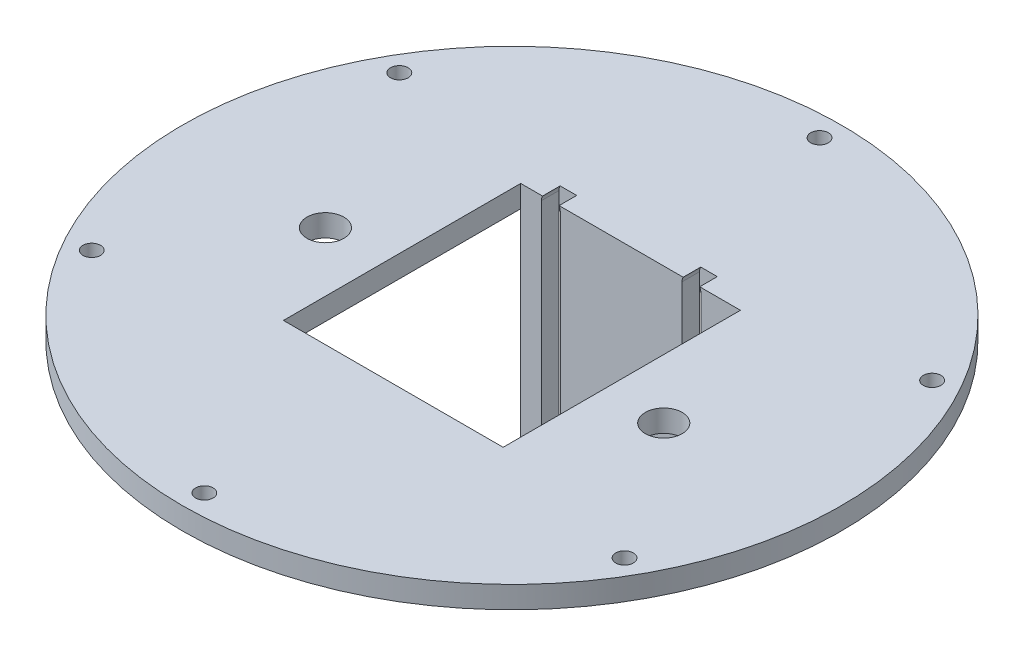
ISO-10303-21;
HEADER;
FILE_DESCRIPTION(('STEP AP214'),'2;1');
FILE_NAME('part.step','',(''),(''),'','','');
FILE_SCHEMA(('AUTOMOTIVE_DESIGN { 1 0 10303 214 1 1 1 1 }'));
ENDSEC;
DATA;
#1=APPLICATION_CONTEXT('core data for automotive mechanical design processes');
#2=APPLICATION_PROTOCOL_DEFINITION('international standard','automotive_design',2000,#1);
#3=PRODUCT_CONTEXT('',#1,'mechanical');
#4=PRODUCT('Part','Part','',(#3));
#5=PRODUCT_RELATED_PRODUCT_CATEGORY('part','',(#4));
#6=PRODUCT_DEFINITION_FORMATION('','',#4);
#7=PRODUCT_DEFINITION_CONTEXT('part definition',#1,'design');
#8=PRODUCT_DEFINITION('design','',#6,#7);
#9=PRODUCT_DEFINITION_SHAPE('','',#8);
#10=(LENGTH_UNIT() NAMED_UNIT(*) SI_UNIT(.MILLI.,.METRE.));
#11=(NAMED_UNIT(*) PLANE_ANGLE_UNIT() SI_UNIT($,.RADIAN.));
#12=(NAMED_UNIT(*) SI_UNIT($,.STERADIAN.) SOLID_ANGLE_UNIT());
#13=UNCERTAINTY_MEASURE_WITH_UNIT(LENGTH_MEASURE(1.E-05),#10,'distance_accuracy_value','');
#14=(GEOMETRIC_REPRESENTATION_CONTEXT(3) GLOBAL_UNCERTAINTY_ASSIGNED_CONTEXT((#13)) GLOBAL_UNIT_ASSIGNED_CONTEXT((#10,
#11,#12)) REPRESENTATION_CONTEXT('',''));
#15=CARTESIAN_POINT('',(0.,0.,0.));
#16=DIRECTION('',(0.,0.,1.));
#17=DIRECTION('',(1.,0.,0.));
#18=AXIS2_PLACEMENT_3D('',#15,#16,#17);
#19=CARTESIAN_POINT('',(0.,5.,0.));
#20=DIRECTION('',(0.,1.,0.));
#21=DIRECTION('',(0.,0.,1.));
#22=AXIS2_PLACEMENT_3D('',#19,#20,#21);
#23=PLANE('',#22);
#24=CARTESIAN_POINT('',(-8.49999999999939,5.,3.95000000000001));
#25=DIRECTION('',(0.,1.,0.));
#26=DIRECTION('',(0.,0.,1.));
#27=AXIS2_PLACEMENT_3D('',#24,#25,#26);
#28=CIRCLE('',#27,4.2);
#29=CARTESIAN_POINT('',(-8.49999999999939,5.,8.15000000000001));
#30=VERTEX_POINT('',#29);
#31=EDGE_CURVE('E264',#30,#30,#28,.T.);
#32=ORIENTED_EDGE('',*,*,#31,.F.);
#33=EDGE_LOOP('',(#32));
#34=FACE_BOUND('',#33,.T.);
#35=CARTESIAN_POINT('',(68.5000000000006,5.,3.94999999999992));
#36=DIRECTION('',(0.,1.,0.));
#37=DIRECTION('',(0.,0.,1.));
#38=AXIS2_PLACEMENT_3D('',#35,#36,#37);
#39=CIRCLE('',#38,4.19999999999999);
#40=CARTESIAN_POINT('',(68.5000000000006,5.,8.14999999999991));
#41=VERTEX_POINT('',#40);
#42=EDGE_CURVE('E269',#41,#41,#39,.T.);
#43=ORIENTED_EDGE('',*,*,#42,.F.);
#44=EDGE_LOOP('',(#43));
#45=FACE_BOUND('',#44,.T.);
#46=CARTESIAN_POINT('',(30.0000000000001,5.,70.));
#47=DIRECTION('',(0.,1.,0.));
#48=DIRECTION('',(0.,0.,1.));
#49=AXIS2_PLACEMENT_3D('',#46,#47,#48);
#50=CIRCLE('',#49,2.);
#51=CARTESIAN_POINT('',(30.0000000000001,5.,72.));
#52=VERTEX_POINT('',#51);
#53=EDGE_CURVE('E281',#52,#52,#50,.T.);
#54=ORIENTED_EDGE('',*,*,#53,.F.);
#55=EDGE_LOOP('',(#54));
#56=FACE_BOUND('',#55,.T.);
#57=CARTESIAN_POINT('',(90.6217782649104,5.,35.0000000000007));
#58=DIRECTION('',(0.,1.,0.));
#59=DIRECTION('',(0.,0.,1.));
#60=AXIS2_PLACEMENT_3D('',#57,#58,#59);
#61=CIRCLE('',#60,2.);
#62=CARTESIAN_POINT('',(90.6217782649104,5.,37.0000000000007));
#63=VERTEX_POINT('',#62);
#64=EDGE_CURVE('E273',#63,#63,#61,.T.);
#65=ORIENTED_EDGE('',*,*,#64,.F.);
#66=EDGE_LOOP('',(#65));
#67=FACE_BOUND('',#66,.T.);
#68=CARTESIAN_POINT('',(90.6217782649111,5.,-34.9999999999994));
#69=DIRECTION('',(0.,1.,0.));
#70=DIRECTION('',(0.,0.,1.));
#71=AXIS2_PLACEMENT_3D('',#68,#69,#70);
#72=CIRCLE('',#71,2.);
#73=CARTESIAN_POINT('',(90.6217782649111,5.,-32.9999999999994));
#74=VERTEX_POINT('',#73);
#75=EDGE_CURVE('E290',#74,#74,#72,.T.);
#76=ORIENTED_EDGE('',*,*,#75,.F.);
#77=EDGE_LOOP('',(#76));
#78=FACE_BOUND('',#77,.T.);
#79=CARTESIAN_POINT('',(30.0000000000006,5.,-70.));
#80=DIRECTION('',(0.,1.,0.));
#81=DIRECTION('',(0.,0.,1.));
#82=AXIS2_PLACEMENT_3D('',#79,#80,#81);
#83=CIRCLE('',#82,2.);
#84=CARTESIAN_POINT('',(30.0000000000006,5.,-68.));
#85=VERTEX_POINT('',#84);
#86=EDGE_CURVE('E298',#85,#85,#83,.T.);
#87=ORIENTED_EDGE('',*,*,#86,.F.);
#88=EDGE_LOOP('',(#87));
#89=FACE_BOUND('',#88,.T.);
#90=CARTESIAN_POINT('',(-30.6217782649105,5.,-35.0000000000003));
#91=DIRECTION('',(0.,1.,0.));
#92=DIRECTION('',(0.,0.,1.));
#93=AXIS2_PLACEMENT_3D('',#90,#91,#92);
#94=CIRCLE('',#93,2.);
#95=CARTESIAN_POINT('',(-30.6217782649105,5.,-33.0000000000003));
#96=VERTEX_POINT('',#95);
#97=EDGE_CURVE('E294',#96,#96,#94,.T.);
#98=ORIENTED_EDGE('',*,*,#97,.F.);
#99=EDGE_LOOP('',(#98));
#100=FACE_BOUND('',#99,.T.);
#101=CARTESIAN_POINT('',(-30.6217782649107,5.,34.9999999999999));
#102=DIRECTION('',(0.,1.,0.));
#103=DIRECTION('',(0.,0.,1.));
#104=AXIS2_PLACEMENT_3D('',#101,#102,#103);
#105=CIRCLE('',#104,2.);
#106=CARTESIAN_POINT('',(-30.6217782649107,5.,36.9999999999999));
#107=VERTEX_POINT('',#106);
#108=EDGE_CURVE('E286',#107,#107,#105,.T.);
#109=ORIENTED_EDGE('',*,*,#108,.F.);
#110=EDGE_LOOP('',(#109));
#111=FACE_BOUND('',#110,.T.);
#112=DIRECTION('',(0.,0.,1.));
#113=VECTOR('',#112,1.);
#114=CARTESIAN_POINT('',(9.96809122210273,5.,-70.3349662310456));
#115=LINE('',#114,#113);
#116=CARTESIAN_POINT('',(9.96809122210273,5.,-31.));
#117=VERTEX_POINT('',#116);
#118=CARTESIAN_POINT('',(9.96809122210273,5.,-27.));
#119=VERTEX_POINT('',#118);
#120=EDGE_CURVE('E338',#117,#119,#115,.T.);
#121=ORIENTED_EDGE('',*,*,#120,.F.);
#122=DIRECTION('',(1.,0.,0.));
#123=VECTOR('',#122,1.);
#124=CARTESIAN_POINT('',(0.,5.,-31.));
#125=LINE('',#124,#123);
#126=CARTESIAN_POINT('',(13.7319087778974,5.,-31.));
#127=VERTEX_POINT('',#126);
#128=EDGE_CURVE('E314',#117,#127,#125,.T.);
#129=ORIENTED_EDGE('',*,*,#128,.T.);
#130=DIRECTION('',(0.,0.,1.));
#131=VECTOR('',#130,1.);
#132=CARTESIAN_POINT('',(13.7319087778974,5.,-70.3349662310456));
#133=LINE('',#132,#131);
#134=CARTESIAN_POINT('',(13.7319087778974,5.,-27.));
#135=VERTEX_POINT('',#134);
#136=EDGE_CURVE('E341',#127,#135,#133,.T.);
#137=ORIENTED_EDGE('',*,*,#136,.T.);
#138=DIRECTION('',(-1.,0.,0.));
#139=VECTOR('',#138,1.);
#140=CARTESIAN_POINT('',(5.00000000000006,5.,-27.));
#141=LINE('',#140,#139);
#142=CARTESIAN_POINT('',(41.9680912221027,5.,-27.));
#143=VERTEX_POINT('',#142);
#144=EDGE_CURVE('E462',#143,#135,#141,.T.);
#145=ORIENTED_EDGE('',*,*,#144,.F.);
#146=DIRECTION('',(0.,0.,1.));
#147=VECTOR('',#146,1.);
#148=CARTESIAN_POINT('',(41.9680912221027,5.,-70.3349662310456));
#149=LINE('',#148,#147);
#150=CARTESIAN_POINT('',(41.9680912221027,5.,-31.));
#151=VERTEX_POINT('',#150);
#152=EDGE_CURVE('E382',#151,#143,#149,.T.);
#153=ORIENTED_EDGE('',*,*,#152,.F.);
#154=DIRECTION('',(1.,0.,0.));
#155=VECTOR('',#154,1.);
#156=CARTESIAN_POINT('',(0.,5.,-31.));
#157=LINE('',#156,#155);
#158=CARTESIAN_POINT('',(45.7319087778974,5.,-31.));
#159=VERTEX_POINT('',#158);
#160=EDGE_CURVE('E354',#151,#159,#157,.T.);
#161=ORIENTED_EDGE('',*,*,#160,.T.);
#162=DIRECTION('',(0.,0.,1.));
#163=VECTOR('',#162,1.);
#164=CARTESIAN_POINT('',(45.7319087778974,5.,-70.3349662310456));
#165=LINE('',#164,#163);
#166=CARTESIAN_POINT('',(45.7319087778974,5.,-27.));
#167=VERTEX_POINT('',#166);
#168=EDGE_CURVE('E385',#159,#167,#165,.T.);
#169=ORIENTED_EDGE('',*,*,#168,.T.);
#170=CARTESIAN_POINT('',(55.0000000000001,5.,-27.));
#171=VERTEX_POINT('',#170);
#172=EDGE_CURVE('E439',#171,#167,#141,.T.);
#173=ORIENTED_EDGE('',*,*,#172,.F.);
#174=DIRECTION('',(0.,0.,-1.));
#175=VECTOR('',#174,1.);
#176=CARTESIAN_POINT('',(55.0000000000001,5.,-27.));
#177=LINE('',#176,#175);
#178=CARTESIAN_POINT('',(55.0000000000001,5.,27.));
#179=VERTEX_POINT('',#178);
#180=EDGE_CURVE('E454',#179,#171,#177,.T.);
#181=ORIENTED_EDGE('',*,*,#180,.F.);
#182=DIRECTION('',(1.,0.,0.));
#183=VECTOR('',#182,1.);
#184=CARTESIAN_POINT('',(5.00000000000006,5.,27.));
#185=LINE('',#184,#183);
#186=CARTESIAN_POINT('',(5.00000000000006,5.,27.));
#187=VERTEX_POINT('',#186);
#188=EDGE_CURVE('E450',#187,#179,#185,.T.);
#189=ORIENTED_EDGE('',*,*,#188,.F.);
#190=DIRECTION('',(0.,0.,1.));
#191=VECTOR('',#190,1.);
#192=CARTESIAN_POINT('',(5.00000000000006,5.,-27.));
#193=LINE('',#192,#191);
#194=CARTESIAN_POINT('',(5.00000000000006,5.,-27.));
#195=VERTEX_POINT('',#194);
#196=EDGE_CURVE('E433',#195,#187,#193,.T.);
#197=ORIENTED_EDGE('',*,*,#196,.F.);
#198=EDGE_CURVE('E458',#119,#195,#141,.T.);
#199=ORIENTED_EDGE('',*,*,#198,.F.);
#200=EDGE_LOOP('',(#121,#129,#137,#145,#153,#161,#169,#173,#181,#189,#197,#199));
#201=FACE_BOUND('',#200,.T.);
#202=CARTESIAN_POINT('',(30.0000000000001,5.,0.));
#203=DIRECTION('',(0.,1.,0.));
#204=DIRECTION('',(0.,0.,1.));
#205=AXIS2_PLACEMENT_3D('',#202,#203,#204);
#206=CIRCLE('',#205,75.);
#207=CARTESIAN_POINT('',(30.0000000000001,5.,75.));
#208=VERTEX_POINT('',#207);
#209=EDGE_CURVE('E305',#208,#208,#206,.T.);
#210=ORIENTED_EDGE('',*,*,#209,.T.);
#211=EDGE_LOOP('',(#210));
#212=FACE_BOUND('',#211,.T.);
#213=ADVANCED_FACE('F65',(#34,#45,#56,#67,#78,#89,#100,#111,#201,#212),#23,.T.);
#214=CARTESIAN_POINT('',(0.,0.,0.));
#215=DIRECTION('',(0.,1.,0.));
#216=DIRECTION('',(0.,0.,1.));
#217=AXIS2_PLACEMENT_3D('',#214,#215,#216);
#218=PLANE('',#217);
#219=CARTESIAN_POINT('',(-8.49999999999939,0.,3.95000000000001));
#220=DIRECTION('',(0.,1.,0.));
#221=DIRECTION('',(0.,0.,1.));
#222=AXIS2_PLACEMENT_3D('',#219,#220,#221);
#223=CIRCLE('',#222,4.2);
#224=CARTESIAN_POINT('',(-8.49999999999939,0.,8.15000000000001));
#225=VERTEX_POINT('',#224);
#226=EDGE_CURVE('E268',#225,#225,#223,.F.);
#227=ORIENTED_EDGE('',*,*,#226,.F.);
#228=EDGE_LOOP('',(#227));
#229=FACE_BOUND('',#228,.T.);
#230=CARTESIAN_POINT('',(68.5000000000006,0.,3.94999999999992));
#231=DIRECTION('',(0.,1.,0.));
#232=DIRECTION('',(0.,0.,1.));
#233=AXIS2_PLACEMENT_3D('',#230,#231,#232);
#234=CIRCLE('',#233,4.19999999999999);
#235=CARTESIAN_POINT('',(68.5000000000006,0.,8.14999999999991));
#236=VERTEX_POINT('',#235);
#237=EDGE_CURVE('E274',#236,#236,#234,.F.);
#238=ORIENTED_EDGE('',*,*,#237,.F.);
#239=EDGE_LOOP('',(#238));
#240=FACE_BOUND('',#239,.T.);
#241=CARTESIAN_POINT('',(30.0000000000001,0.,70.));
#242=DIRECTION('',(0.,1.,0.));
#243=DIRECTION('',(0.,0.,1.));
#244=AXIS2_PLACEMENT_3D('',#241,#242,#243);
#245=CIRCLE('',#244,2.);
#246=CARTESIAN_POINT('',(30.0000000000001,0.,72.));
#247=VERTEX_POINT('',#246);
#248=EDGE_CURVE('E69',#247,#247,#245,.T.);
#249=ORIENTED_EDGE('',*,*,#248,.T.);
#250=EDGE_LOOP('',(#249));
#251=FACE_BOUND('',#250,.T.);
#252=CARTESIAN_POINT('',(90.6217782649104,0.,35.0000000000007));
#253=DIRECTION('',(0.,1.,0.));
#254=DIRECTION('',(0.,0.,1.));
#255=AXIS2_PLACEMENT_3D('',#252,#253,#254);
#256=CIRCLE('',#255,2.);
#257=CARTESIAN_POINT('',(90.6217782649104,0.,37.0000000000007));
#258=VERTEX_POINT('',#257);
#259=EDGE_CURVE('E492',#258,#258,#256,.T.);
#260=ORIENTED_EDGE('',*,*,#259,.T.);
#261=EDGE_LOOP('',(#260));
#262=FACE_BOUND('',#261,.T.);
#263=CARTESIAN_POINT('',(90.6217782649111,0.,-34.9999999999994));
#264=DIRECTION('',(0.,1.,0.));
#265=DIRECTION('',(0.,0.,1.));
#266=AXIS2_PLACEMENT_3D('',#263,#264,#265);
#267=CIRCLE('',#266,2.);
#268=CARTESIAN_POINT('',(90.6217782649111,0.,-32.9999999999994));
#269=VERTEX_POINT('',#268);
#270=EDGE_CURVE('E489',#269,#269,#267,.T.);
#271=ORIENTED_EDGE('',*,*,#270,.T.);
#272=EDGE_LOOP('',(#271));
#273=FACE_BOUND('',#272,.T.);
#274=CARTESIAN_POINT('',(30.0000000000006,0.,-70.));
#275=DIRECTION('',(0.,1.,0.));
#276=DIRECTION('',(0.,0.,1.));
#277=AXIS2_PLACEMENT_3D('',#274,#275,#276);
#278=CIRCLE('',#277,2.);
#279=CARTESIAN_POINT('',(30.0000000000006,0.,-68.));
#280=VERTEX_POINT('',#279);
#281=EDGE_CURVE('E485',#280,#280,#278,.T.);
#282=ORIENTED_EDGE('',*,*,#281,.T.);
#283=EDGE_LOOP('',(#282));
#284=FACE_BOUND('',#283,.T.);
#285=CARTESIAN_POINT('',(-30.6217782649105,0.,-35.0000000000003));
#286=DIRECTION('',(0.,1.,0.));
#287=DIRECTION('',(0.,0.,1.));
#288=AXIS2_PLACEMENT_3D('',#285,#286,#287);
#289=CIRCLE('',#288,2.);
#290=CARTESIAN_POINT('',(-30.6217782649105,0.,-33.0000000000003));
#291=VERTEX_POINT('',#290);
#292=EDGE_CURVE('E481',#291,#291,#289,.T.);
#293=ORIENTED_EDGE('',*,*,#292,.T.);
#294=EDGE_LOOP('',(#293));
#295=FACE_BOUND('',#294,.T.);
#296=CARTESIAN_POINT('',(-30.6217782649107,0.,34.9999999999999));
#297=DIRECTION('',(0.,1.,0.));
#298=DIRECTION('',(0.,0.,1.));
#299=AXIS2_PLACEMENT_3D('',#296,#297,#298);
#300=CIRCLE('',#299,2.);
#301=CARTESIAN_POINT('',(-30.6217782649107,0.,36.9999999999999));
#302=VERTEX_POINT('',#301);
#303=EDGE_CURVE('E285',#302,#302,#300,.T.);
#304=ORIENTED_EDGE('',*,*,#303,.T.);
#305=EDGE_LOOP('',(#304));
#306=FACE_BOUND('',#305,.T.);
#307=DIRECTION('',(0.,0.,-1.));
#308=VECTOR('',#307,1.);
#309=CARTESIAN_POINT('',(5.00000000000006,0.,-27.));
#310=LINE('',#309,#308);
#311=CARTESIAN_POINT('',(5.00000000000006,0.,-27.));
#312=VERTEX_POINT('',#311);
#313=CARTESIAN_POINT('',(5.00000000000006,0.,-31.));
#314=VERTEX_POINT('',#313);
#315=EDGE_CURVE('E349',#312,#314,#310,.T.);
#316=ORIENTED_EDGE('',*,*,#315,.F.);
#317=DIRECTION('',(0.,0.,1.));
#318=VECTOR('',#317,1.);
#319=CARTESIAN_POINT('',(5.00000000000006,0.,-27.));
#320=LINE('',#319,#318);
#321=CARTESIAN_POINT('',(5.00000000000006,0.,27.));
#322=VERTEX_POINT('',#321);
#323=EDGE_CURVE('E434',#312,#322,#320,.T.);
#324=ORIENTED_EDGE('',*,*,#323,.T.);
#325=DIRECTION('',(1.,0.,0.));
#326=VECTOR('',#325,1.);
#327=CARTESIAN_POINT('',(5.00000000000006,0.,27.));
#328=LINE('',#327,#326);
#329=CARTESIAN_POINT('',(55.0000000000001,0.,27.));
#330=VERTEX_POINT('',#329);
#331=EDGE_CURVE('E438',#322,#330,#328,.T.);
#332=ORIENTED_EDGE('',*,*,#331,.T.);
#333=DIRECTION('',(0.,0.,-1.));
#334=VECTOR('',#333,1.);
#335=CARTESIAN_POINT('',(55.0000000000001,0.,-27.));
#336=LINE('',#335,#334);
#337=CARTESIAN_POINT('',(55.0000000000001,0.,-27.));
#338=VERTEX_POINT('',#337);
#339=EDGE_CURVE('E443',#330,#338,#336,.T.);
#340=ORIENTED_EDGE('',*,*,#339,.T.);
#341=DIRECTION('',(0.,0.,1.));
#342=VECTOR('',#341,1.);
#343=CARTESIAN_POINT('',(55.0000000000001,0.,-27.));
#344=LINE('',#343,#342);
#345=CARTESIAN_POINT('',(55.0000000000001,0.,-31.));
#346=VERTEX_POINT('',#345);
#347=EDGE_CURVE('E399',#346,#338,#344,.T.);
#348=ORIENTED_EDGE('',*,*,#347,.F.);
#349=DIRECTION('',(1.,0.,0.));
#350=VECTOR('',#349,1.);
#351=CARTESIAN_POINT('',(5.00000000000006,0.,-31.));
#352=LINE('',#351,#350);
#353=CARTESIAN_POINT('',(46.0000000000001,0.,-31.));
#354=VERTEX_POINT('',#353);
#355=EDGE_CURVE('E412',#354,#346,#352,.T.);
#356=ORIENTED_EDGE('',*,*,#355,.F.);
#357=CARTESIAN_POINT('',(41.7000000000001,0.,-31.));
#358=VERTEX_POINT('',#357);
#359=EDGE_CURVE('E662',#358,#354,#352,.T.);
#360=ORIENTED_EDGE('',*,*,#359,.F.);
#361=CARTESIAN_POINT('',(14.0000000000001,0.,-31.));
#362=VERTEX_POINT('',#361);
#363=EDGE_CURVE('E659',#362,#358,#352,.T.);
#364=ORIENTED_EDGE('',*,*,#363,.F.);
#365=CARTESIAN_POINT('',(9.70000000000008,0.,-31.));
#366=VERTEX_POINT('',#365);
#367=EDGE_CURVE('E415',#366,#362,#352,.T.);
#368=ORIENTED_EDGE('',*,*,#367,.F.);
#369=EDGE_CURVE('E91',#314,#366,#352,.T.);
#370=ORIENTED_EDGE('',*,*,#369,.F.);
#371=EDGE_LOOP('',(#316,#324,#332,#340,#348,#356,#360,#364,#368,#370));
#372=FACE_BOUND('',#371,.T.);
#373=CARTESIAN_POINT('',(30.0000000000001,0.,0.));
#374=DIRECTION('',(0.,1.,0.));
#375=DIRECTION('',(0.,0.,1.));
#376=AXIS2_PLACEMENT_3D('',#373,#374,#375);
#377=CIRCLE('',#376,75.);
#378=CARTESIAN_POINT('',(30.0000000000001,0.,75.));
#379=VERTEX_POINT('',#378);
#380=EDGE_CURVE('E309',#379,#379,#377,.T.);
#381=ORIENTED_EDGE('',*,*,#380,.F.);
#382=EDGE_LOOP('',(#381));
#383=FACE_BOUND('',#382,.T.);
#384=ADVANCED_FACE('F67',(#229,#240,#251,#262,#273,#284,#295,#306,#372,#383),#218,.F.);
#385=CARTESIAN_POINT('',(5.00000000000006,0.,-27.));
#386=DIRECTION('',(0.,0.,-1.));
#387=DIRECTION('',(-1.,0.,0.));
#388=AXIS2_PLACEMENT_3D('',#385,#386,#387);
#389=PLANE('',#388);
#390=DIRECTION('',(0.,1.,0.));
#391=VECTOR('',#390,1.);
#392=CARTESIAN_POINT('',(14.0000000000001,0.,-27.));
#393=LINE('',#392,#391);
#394=CARTESIAN_POINT('',(14.0000000000001,-40.5713713836583,-27.));
#395=VERTEX_POINT('',#394);
#396=CARTESIAN_POINT('',(14.0000000000001,3.96032728627086,-27.));
#397=VERTEX_POINT('',#396);
#398=EDGE_CURVE('E83',#395,#397,#393,.T.);
#399=ORIENTED_EDGE('',*,*,#398,.F.);
#400=CARTESIAN_POINT('',(11.8500000000001,-40.5713713836583,-27.));
#401=DIRECTION('',(0.,0.,1.));
#402=DIRECTION('',(-1.,0.,0.));
#403=AXIS2_PLACEMENT_3D('',#400,#401,#402);
#404=CIRCLE('',#403,2.15);
#405=CARTESIAN_POINT('',(9.70000000000013,-40.5713713836583,-27.));
#406=VERTEX_POINT('',#405);
#407=EDGE_CURVE('E234',#406,#395,#404,.T.);
#408=ORIENTED_EDGE('',*,*,#407,.F.);
#409=DIRECTION('',(0.,-1.,0.));
#410=VECTOR('',#409,1.);
#411=CARTESIAN_POINT('',(9.70000000000008,0.,-27.));
#412=LINE('',#411,#410);
#413=CARTESIAN_POINT('',(9.70000000000008,3.96032728627086,-27.));
#414=VERTEX_POINT('',#413);
#415=EDGE_CURVE('E214',#414,#406,#412,.T.);
#416=ORIENTED_EDGE('',*,*,#415,.F.);
#417=CARTESIAN_POINT('',(11.8500000000001,3.96032728627086,-27.));
#418=DIRECTION('',(0.,0.,1.));
#419=DIRECTION('',(1.,0.,0.));
#420=AXIS2_PLACEMENT_3D('',#417,#418,#419);
#421=CIRCLE('',#420,2.15);
#422=EDGE_CURVE('E227',#119,#414,#421,.T.);
#423=ORIENTED_EDGE('',*,*,#422,.F.);
#424=ORIENTED_EDGE('',*,*,#198,.T.);
#425=DIRECTION('',(0.,1.,0.));
#426=VECTOR('',#425,1.);
#427=CARTESIAN_POINT('',(5.00000000000006,0.,-27.));
#428=LINE('',#427,#426);
#429=EDGE_CURVE('E463',#312,#195,#428,.T.);
#430=ORIENTED_EDGE('',*,*,#429,.F.);
#431=DIRECTION('',(0.,1.,0.));
#432=VECTOR('',#431,1.);
#433=CARTESIAN_POINT('',(5.00000000000006,-45.,-27.));
#434=LINE('',#433,#432);
#435=CARTESIAN_POINT('',(5.00000000000006,-45.,-27.));
#436=VERTEX_POINT('',#435);
#437=EDGE_CURVE('E408',#436,#312,#434,.T.);
#438=ORIENTED_EDGE('',*,*,#437,.F.);
#439=DIRECTION('',(-1.,0.,0.));
#440=VECTOR('',#439,1.);
#441=CARTESIAN_POINT('',(5.00000000000006,-45.,-27.));
#442=LINE('',#441,#440);
#443=CARTESIAN_POINT('',(55.0000000000001,-45.,-27.));
#444=VERTEX_POINT('',#443);
#445=EDGE_CURVE('E405',#444,#436,#442,.T.);
#446=ORIENTED_EDGE('',*,*,#445,.F.);
#447=DIRECTION('',(0.,1.,0.));
#448=VECTOR('',#447,1.);
#449=CARTESIAN_POINT('',(55.0000000000001,-45.,-27.));
#450=LINE('',#449,#448);
#451=EDGE_CURVE('E422',#444,#338,#450,.T.);
#452=ORIENTED_EDGE('',*,*,#451,.T.);
#453=DIRECTION('',(0.,1.,0.));
#454=VECTOR('',#453,1.);
#455=CARTESIAN_POINT('',(55.0000000000001,0.,-27.));
#456=LINE('',#455,#454);
#457=EDGE_CURVE('E467',#338,#171,#456,.T.);
#458=ORIENTED_EDGE('',*,*,#457,.T.);
#459=ORIENTED_EDGE('',*,*,#172,.T.);
#460=CARTESIAN_POINT('',(43.8500000000001,3.96032728627086,-27.));
#461=DIRECTION('',(0.,0.,1.));
#462=DIRECTION('',(1.,0.,0.));
#463=AXIS2_PLACEMENT_3D('',#460,#461,#462);
#464=CIRCLE('',#463,2.15);
#465=CARTESIAN_POINT('',(46.0000000000001,3.96032728627086,-27.));
#466=VERTEX_POINT('',#465);
#467=EDGE_CURVE('E368',#167,#466,#464,.F.);
#468=ORIENTED_EDGE('',*,*,#467,.T.);
#469=DIRECTION('',(0.,-1.,0.));
#470=VECTOR('',#469,1.);
#471=CARTESIAN_POINT('',(46.0000000000001,0.,-27.));
#472=LINE('',#471,#470);
#473=CARTESIAN_POINT('',(46.0000000000001,-36.9492272097225,-27.));
#474=VERTEX_POINT('',#473);
#475=EDGE_CURVE('E313',#466,#474,#472,.T.);
#476=ORIENTED_EDGE('',*,*,#475,.T.);
#477=CARTESIAN_POINT('',(43.8500000000001,-36.9492272097225,-27.));
#478=DIRECTION('',(0.,0.,1.));
#479=DIRECTION('',(1.,0.,0.));
#480=AXIS2_PLACEMENT_3D('',#477,#478,#479);
#481=CIRCLE('',#480,2.15);
#482=CARTESIAN_POINT('',(41.7000000000001,-36.9492272097225,-27.));
#483=VERTEX_POINT('',#482);
#484=EDGE_CURVE('E243',#483,#474,#481,.T.);
#485=ORIENTED_EDGE('',*,*,#484,.F.);
#486=DIRECTION('',(0.,1.,0.));
#487=VECTOR('',#486,1.);
#488=CARTESIAN_POINT('',(41.7000000000001,0.,-27.));
#489=LINE('',#488,#487);
#490=CARTESIAN_POINT('',(41.7000000000001,3.96032728627086,-27.));
#491=VERTEX_POINT('',#490);
#492=EDGE_CURVE('E373',#483,#491,#489,.T.);
#493=ORIENTED_EDGE('',*,*,#492,.T.);
#494=EDGE_CURVE('E372',#491,#143,#464,.F.);
#495=ORIENTED_EDGE('',*,*,#494,.T.);
#496=ORIENTED_EDGE('',*,*,#144,.T.);
#497=EDGE_CURVE('E332',#397,#135,#421,.T.);
#498=ORIENTED_EDGE('',*,*,#497,.F.);
#499=EDGE_LOOP('',(#399,#408,#416,#423,#424,#430,#438,#446,#452,#458,#459,#468,#476,#485,#493,
#495,#496,#498));
#500=FACE_BOUND('',#499,.T.);
#501=ADVANCED_FACE('F240',(#500),#389,.F.);
#502=CARTESIAN_POINT('',(5.00000000000006,-45.,-31.));
#503=DIRECTION('',(0.,0.,1.));
#504=DIRECTION('',(1.,0.,0.));
#505=AXIS2_PLACEMENT_3D('',#502,#503,#504);
#506=PLANE('',#505);
#507=CARTESIAN_POINT('',(11.8500000000001,-40.5713713836583,-31.));
#508=DIRECTION('',(0.,0.,1.));
#509=DIRECTION('',(1.,0.,0.));
#510=AXIS2_PLACEMENT_3D('',#507,#508,#509);
#511=CIRCLE('',#510,2.15);
#512=CARTESIAN_POINT('',(14.0000000000001,-40.5713713836583,-31.));
#513=VERTEX_POINT('',#512);
#514=CARTESIAN_POINT('',(9.70000000000013,-40.5713713836583,-31.));
#515=VERTEX_POINT('',#514);
#516=EDGE_CURVE('E236',#513,#515,#511,.F.);
#517=ORIENTED_EDGE('',*,*,#516,.F.);
#518=DIRECTION('',(0.,1.,0.));
#519=VECTOR('',#518,1.);
#520=CARTESIAN_POINT('',(14.0000000000001,-45.,-31.));
#521=LINE('',#520,#519);
#522=EDGE_CURVE('E13',#513,#362,#521,.T.);
#523=ORIENTED_EDGE('',*,*,#522,.T.);
#524=ORIENTED_EDGE('',*,*,#363,.T.);
#525=DIRECTION('',(0.,1.,0.));
#526=VECTOR('',#525,1.);
#527=CARTESIAN_POINT('',(41.7000000000001,-45.,-31.));
#528=LINE('',#527,#526);
#529=CARTESIAN_POINT('',(41.7000000000001,-36.9492272097225,-31.));
#530=VERTEX_POINT('',#529);
#531=EDGE_CURVE('E75',#530,#358,#528,.T.);
#532=ORIENTED_EDGE('',*,*,#531,.F.);
#533=CARTESIAN_POINT('',(43.8500000000001,-36.9492272097225,-31.));
#534=DIRECTION('',(0.,0.,1.));
#535=DIRECTION('',(1.,0.,0.));
#536=AXIS2_PLACEMENT_3D('',#533,#534,#535);
#537=CIRCLE('',#536,2.15);
#538=CARTESIAN_POINT('',(46.0000000000001,-36.9492272097225,-31.));
#539=VERTEX_POINT('',#538);
#540=EDGE_CURVE('E259',#539,#530,#537,.F.);
#541=ORIENTED_EDGE('',*,*,#540,.F.);
#542=DIRECTION('',(0.,1.,0.));
#543=VECTOR('',#542,1.);
#544=CARTESIAN_POINT('',(46.0000000000001,0.,-31.));
#545=LINE('',#544,#543);
#546=EDGE_CURVE('E355',#539,#354,#545,.T.);
#547=ORIENTED_EDGE('',*,*,#546,.T.);
#548=ORIENTED_EDGE('',*,*,#355,.T.);
#549=DIRECTION('',(0.,1.,0.));
#550=VECTOR('',#549,1.);
#551=CARTESIAN_POINT('',(55.0000000000001,-45.,-31.));
#552=LINE('',#551,#550);
#553=CARTESIAN_POINT('',(55.0000000000001,-45.,-31.));
#554=VERTEX_POINT('',#553);
#555=EDGE_CURVE('E426',#554,#346,#552,.T.);
#556=ORIENTED_EDGE('',*,*,#555,.F.);
#557=DIRECTION('',(1.,0.,0.));
#558=VECTOR('',#557,1.);
#559=CARTESIAN_POINT('',(5.00000000000006,-45.,-31.));
#560=LINE('',#559,#558);
#561=CARTESIAN_POINT('',(5.00000000000006,-45.,-31.));
#562=VERTEX_POINT('',#561);
#563=EDGE_CURVE('E398',#562,#554,#560,.T.);
#564=ORIENTED_EDGE('',*,*,#563,.F.);
#565=DIRECTION('',(0.,1.,0.));
#566=VECTOR('',#565,1.);
#567=CARTESIAN_POINT('',(5.00000000000006,-45.,-31.));
#568=LINE('',#567,#566);
#569=EDGE_CURVE('E430',#562,#314,#568,.T.);
#570=ORIENTED_EDGE('',*,*,#569,.T.);
#571=ORIENTED_EDGE('',*,*,#369,.T.);
#572=DIRECTION('',(0.,1.,0.));
#573=VECTOR('',#572,1.);
#574=CARTESIAN_POINT('',(9.70000000000008,0.,-31.));
#575=LINE('',#574,#573);
#576=EDGE_CURVE('E322',#515,#366,#575,.T.);
#577=ORIENTED_EDGE('',*,*,#576,.F.);
#578=EDGE_LOOP('',(#517,#523,#524,#532,#541,#547,#548,#556,#564,#570,#571,#577));
#579=FACE_BOUND('',#578,.T.);
#580=ADVANCED_FACE('F530',(#579),#506,.F.);
#581=CARTESIAN_POINT('',(5.00000000000006,0.,-27.));
#582=DIRECTION('',(-1.,0.,0.));
#583=DIRECTION('',(0.,0.,1.));
#584=AXIS2_PLACEMENT_3D('',#581,#582,#583);
#585=PLANE('',#584);
#586=ORIENTED_EDGE('',*,*,#196,.T.);
#587=DIRECTION('',(0.,1.,0.));
#588=VECTOR('',#587,1.);
#589=CARTESIAN_POINT('',(5.00000000000006,0.,27.));
#590=LINE('',#589,#588);
#591=EDGE_CURVE('E447',#322,#187,#590,.T.);
#592=ORIENTED_EDGE('',*,*,#591,.F.);
#593=ORIENTED_EDGE('',*,*,#323,.F.);
#594=ORIENTED_EDGE('',*,*,#429,.T.);
#595=EDGE_LOOP('',(#586,#592,#593,#594));
#596=FACE_BOUND('',#595,.T.);
#597=ADVANCED_FACE('F526',(#596),#585,.F.);
#598=CARTESIAN_POINT('',(55.0000000000001,0.,-27.));
#599=DIRECTION('',(1.,0.,0.));
#600=DIRECTION('',(0.,0.,-1.));
#601=AXIS2_PLACEMENT_3D('',#598,#599,#600);
#602=PLANE('',#601);
#603=ORIENTED_EDGE('',*,*,#180,.T.);
#604=ORIENTED_EDGE('',*,*,#457,.F.);
#605=ORIENTED_EDGE('',*,*,#339,.F.);
#606=DIRECTION('',(0.,1.,0.));
#607=VECTOR('',#606,1.);
#608=CARTESIAN_POINT('',(55.0000000000001,0.,27.));
#609=LINE('',#608,#607);
#610=EDGE_CURVE('E470',#330,#179,#609,.T.);
#611=ORIENTED_EDGE('',*,*,#610,.T.);
#612=EDGE_LOOP('',(#603,#604,#605,#611));
#613=FACE_BOUND('',#612,.T.);
#614=ADVANCED_FACE('F529',(#613),#602,.F.);
#615=CARTESIAN_POINT('',(5.00000000000006,0.,27.));
#616=DIRECTION('',(0.,0.,1.));
#617=DIRECTION('',(1.,0.,0.));
#618=AXIS2_PLACEMENT_3D('',#615,#616,#617);
#619=PLANE('',#618);
#620=ORIENTED_EDGE('',*,*,#188,.T.);
#621=ORIENTED_EDGE('',*,*,#610,.F.);
#622=ORIENTED_EDGE('',*,*,#331,.F.);
#623=ORIENTED_EDGE('',*,*,#591,.T.);
#624=EDGE_LOOP('',(#620,#621,#622,#623));
#625=FACE_BOUND('',#624,.T.);
#626=ADVANCED_FACE('F532',(#625),#619,.F.);
#627=CARTESIAN_POINT('',(5.00000000000006,-45.,-27.));
#628=DIRECTION('',(1.,0.,0.));
#629=DIRECTION('',(0.,0.,-1.));
#630=AXIS2_PLACEMENT_3D('',#627,#628,#629);
#631=PLANE('',#630);
#632=ORIENTED_EDGE('',*,*,#315,.T.);
#633=ORIENTED_EDGE('',*,*,#569,.F.);
#634=DIRECTION('',(0.,0.,-1.));
#635=VECTOR('',#634,1.);
#636=CARTESIAN_POINT('',(5.00000000000006,-45.,-27.));
#637=LINE('',#636,#635);
#638=EDGE_CURVE('E394',#436,#562,#637,.T.);
#639=ORIENTED_EDGE('',*,*,#638,.F.);
#640=ORIENTED_EDGE('',*,*,#437,.T.);
#641=EDGE_LOOP('',(#632,#633,#639,#640));
#642=FACE_BOUND('',#641,.T.);
#643=ADVANCED_FACE('F535',(#642),#631,.F.);
#644=CARTESIAN_POINT('',(55.0000000000001,-45.,-27.));
#645=DIRECTION('',(-1.,0.,0.));
#646=DIRECTION('',(0.,0.,1.));
#647=AXIS2_PLACEMENT_3D('',#644,#645,#646);
#648=PLANE('',#647);
#649=ORIENTED_EDGE('',*,*,#347,.T.);
#650=ORIENTED_EDGE('',*,*,#451,.F.);
#651=DIRECTION('',(0.,0.,1.));
#652=VECTOR('',#651,1.);
#653=CARTESIAN_POINT('',(55.0000000000001,-45.,-27.));
#654=LINE('',#653,#652);
#655=EDGE_CURVE('E402',#554,#444,#654,.T.);
#656=ORIENTED_EDGE('',*,*,#655,.F.);
#657=ORIENTED_EDGE('',*,*,#555,.T.);
#658=EDGE_LOOP('',(#649,#650,#656,#657));
#659=FACE_BOUND('',#658,.T.);
#660=ADVANCED_FACE('F544',(#659),#648,.F.);
#661=CARTESIAN_POINT('',(0.,-45.,0.));
#662=DIRECTION('',(0.,-1.,0.));
#663=DIRECTION('',(0.,0.,-1.));
#664=AXIS2_PLACEMENT_3D('',#661,#662,#663);
#665=PLANE('',#664);
#666=ORIENTED_EDGE('',*,*,#638,.T.);
#667=ORIENTED_EDGE('',*,*,#563,.T.);
#668=ORIENTED_EDGE('',*,*,#655,.T.);
#669=ORIENTED_EDGE('',*,*,#445,.T.);
#670=EDGE_LOOP('',(#666,#667,#668,#669));
#671=FACE_BOUND('',#670,.T.);
#672=ADVANCED_FACE('F551',(#671),#665,.T.);
#673=CARTESIAN_POINT('',(5.00000000000006,-45.,-31.));
#674=DIRECTION('',(0.,0.,1.));
#675=DIRECTION('',(1.,0.,0.));
#676=AXIS2_PLACEMENT_3D('',#673,#674,#675);
#677=PLANE('',#676);
#678=ORIENTED_EDGE('',*,*,#359,.T.);
#679=CARTESIAN_POINT('',(46.0000000000001,3.96032728627086,-31.));
#680=VERTEX_POINT('',#679);
#681=EDGE_CURVE('E381',#354,#680,#545,.T.);
#682=ORIENTED_EDGE('',*,*,#681,.T.);
#683=CARTESIAN_POINT('',(43.8500000000001,3.96032728627086,-31.));
#684=DIRECTION('',(0.,0.,1.));
#685=DIRECTION('',(1.,0.,0.));
#686=AXIS2_PLACEMENT_3D('',#683,#684,#685);
#687=CIRCLE('',#686,2.15);
#688=EDGE_CURVE('E350',#680,#159,#687,.T.);
#689=ORIENTED_EDGE('',*,*,#688,.T.);
#690=ORIENTED_EDGE('',*,*,#160,.F.);
#691=CARTESIAN_POINT('',(43.8500000000001,3.96032728627086,-31.));
#692=DIRECTION('',(0.,0.,1.));
#693=DIRECTION('',(1.,0.,0.));
#694=AXIS2_PLACEMENT_3D('',#691,#692,#693);
#695=CIRCLE('',#694,2.15);
#696=CARTESIAN_POINT('',(41.7000000000001,3.96032728627086,-31.));
#697=VERTEX_POINT('',#696);
#698=EDGE_CURVE('E359',#151,#697,#695,.T.);
#699=ORIENTED_EDGE('',*,*,#698,.T.);
#700=DIRECTION('',(0.,-1.,0.));
#701=VECTOR('',#700,1.);
#702=CARTESIAN_POINT('',(41.7000000000001,0.,-31.));
#703=LINE('',#702,#701);
#704=EDGE_CURVE('E333',#697,#358,#703,.T.);
#705=ORIENTED_EDGE('',*,*,#704,.T.);
#706=EDGE_LOOP('',(#678,#682,#689,#690,#699,#705));
#707=FACE_BOUND('',#706,.T.);
#708=ADVANCED_FACE('F555',(#707),#677,.T.);
#709=CARTESIAN_POINT('',(46.0000000000001,0.,-70.3349662310456));
#710=DIRECTION('',(-1.,0.,0.));
#711=DIRECTION('',(0.,0.,1.));
#712=AXIS2_PLACEMENT_3D('',#709,#710,#711);
#713=PLANE('',#712);
#714=ORIENTED_EDGE('',*,*,#546,.F.);
#715=DIRECTION('',(0.,0.,1.));
#716=VECTOR('',#715,1.);
#717=CARTESIAN_POINT('',(46.0000000000001,-36.9492272097225,-67.7763566540693));
#718=LINE('',#717,#716);
#719=EDGE_CURVE('E256',#539,#474,#718,.T.);
#720=ORIENTED_EDGE('',*,*,#719,.T.);
#721=ORIENTED_EDGE('',*,*,#475,.F.);
#722=DIRECTION('',(0.,0.,1.));
#723=VECTOR('',#722,1.);
#724=CARTESIAN_POINT('',(46.0000000000001,3.96032728627086,-70.3349662310456));
#725=LINE('',#724,#723);
#726=EDGE_CURVE('E377',#680,#466,#725,.T.);
#727=ORIENTED_EDGE('',*,*,#726,.F.);
#728=ORIENTED_EDGE('',*,*,#681,.F.);
#729=EDGE_LOOP('',(#714,#720,#721,#727,#728));
#730=FACE_BOUND('',#729,.T.);
#731=ADVANCED_FACE('F557',(#730),#713,.T.);
#732=CARTESIAN_POINT('',(43.8500000000001,3.96032728627086,-70.3349662310456));
#733=DIRECTION('',(0.,0.,1.));
#734=DIRECTION('',(1.,0.,0.));
#735=AXIS2_PLACEMENT_3D('',#732,#733,#734);
#736=CYLINDRICAL_SURFACE('',#735,2.15);
#737=ORIENTED_EDGE('',*,*,#726,.T.);
#738=ORIENTED_EDGE('',*,*,#467,.F.);
#739=ORIENTED_EDGE('',*,*,#168,.F.);
#740=ORIENTED_EDGE('',*,*,#688,.F.);
#741=EDGE_LOOP('',(#737,#738,#739,#740));
#742=FACE_BOUND('',#741,.T.);
#743=ADVANCED_FACE('F560',(#742),#736,.F.);
#744=ORIENTED_EDGE('',*,*,#152,.T.);
#745=ORIENTED_EDGE('',*,*,#494,.F.);
#746=DIRECTION('',(0.,0.,1.));
#747=VECTOR('',#746,1.);
#748=CARTESIAN_POINT('',(41.7000000000001,3.96032728627086,-70.3349662310456));
#749=LINE('',#748,#747);
#750=EDGE_CURVE('E378',#697,#491,#749,.T.);
#751=ORIENTED_EDGE('',*,*,#750,.F.);
#752=ORIENTED_EDGE('',*,*,#698,.F.);
#753=EDGE_LOOP('',(#744,#745,#751,#752));
#754=FACE_BOUND('',#753,.T.);
#755=ADVANCED_FACE('F562',(#754),#736,.F.);
#756=CARTESIAN_POINT('',(41.7000000000001,0.,-70.3349662310456));
#757=DIRECTION('',(1.,0.,0.));
#758=DIRECTION('',(0.,0.,-1.));
#759=AXIS2_PLACEMENT_3D('',#756,#757,#758);
#760=PLANE('',#759);
#761=ORIENTED_EDGE('',*,*,#750,.T.);
#762=ORIENTED_EDGE('',*,*,#492,.F.);
#763=DIRECTION('',(0.,0.,1.));
#764=VECTOR('',#763,1.);
#765=CARTESIAN_POINT('',(41.7000000000001,-36.9492272097225,-67.7763566540693));
#766=LINE('',#765,#764);
#767=EDGE_CURVE('E247',#530,#483,#766,.T.);
#768=ORIENTED_EDGE('',*,*,#767,.F.);
#769=ORIENTED_EDGE('',*,*,#531,.T.);
#770=ORIENTED_EDGE('',*,*,#704,.F.);
#771=EDGE_LOOP('',(#761,#762,#768,#769,#770));
#772=FACE_BOUND('',#771,.T.);
#773=ADVANCED_FACE('F565',(#772),#760,.T.);
#774=CARTESIAN_POINT('',(5.00000000000006,-45.,-31.));
#775=DIRECTION('',(0.,0.,1.));
#776=DIRECTION('',(1.,0.,0.));
#777=AXIS2_PLACEMENT_3D('',#774,#775,#776);
#778=PLANE('',#777);
#779=ORIENTED_EDGE('',*,*,#367,.T.);
#780=DIRECTION('',(0.,-1.,0.));
#781=VECTOR('',#780,1.);
#782=CARTESIAN_POINT('',(14.0000000000001,0.,-31.));
#783=LINE('',#782,#781);
#784=CARTESIAN_POINT('',(14.0000000000001,3.96032728627086,-31.));
#785=VERTEX_POINT('',#784);
#786=EDGE_CURVE('E325',#785,#362,#783,.T.);
#787=ORIENTED_EDGE('',*,*,#786,.F.);
#788=CARTESIAN_POINT('',(11.8500000000001,3.96032728627086,-31.));
#789=DIRECTION('',(0.,0.,1.));
#790=DIRECTION('',(1.,0.,0.));
#791=AXIS2_PLACEMENT_3D('',#788,#789,#790);
#792=CIRCLE('',#791,2.15);
#793=EDGE_CURVE('E329',#127,#785,#792,.F.);
#794=ORIENTED_EDGE('',*,*,#793,.F.);
#795=ORIENTED_EDGE('',*,*,#128,.F.);
#796=CARTESIAN_POINT('',(11.8500000000001,3.96032728627086,-31.));
#797=DIRECTION('',(0.,0.,1.));
#798=DIRECTION('',(1.,0.,0.));
#799=AXIS2_PLACEMENT_3D('',#796,#797,#798);
#800=CIRCLE('',#799,2.15);
#801=CARTESIAN_POINT('',(9.70000000000008,3.96032728627086,-31.));
#802=VERTEX_POINT('',#801);
#803=EDGE_CURVE('E318',#802,#117,#800,.F.);
#804=ORIENTED_EDGE('',*,*,#803,.F.);
#805=EDGE_CURVE('E321',#366,#802,#575,.T.);
#806=ORIENTED_EDGE('',*,*,#805,.F.);
#807=EDGE_LOOP('',(#779,#787,#794,#795,#804,#806));
#808=FACE_BOUND('',#807,.T.);
#809=ADVANCED_FACE('F569',(#808),#778,.T.);
#810=CARTESIAN_POINT('',(14.0000000000001,0.,-70.3349662310456));
#811=DIRECTION('',(1.,0.,0.));
#812=DIRECTION('',(0.,1.,0.));
#813=AXIS2_PLACEMENT_3D('',#810,#811,#812);
#814=PLANE('',#813);
#815=ORIENTED_EDGE('',*,*,#786,.T.);
#816=ORIENTED_EDGE('',*,*,#522,.F.);
#817=DIRECTION('',(0.,0.,1.));
#818=VECTOR('',#817,1.);
#819=CARTESIAN_POINT('',(14.0000000000001,-40.5713713836583,-67.7763566540693));
#820=LINE('',#819,#818);
#821=EDGE_CURVE('E238',#513,#395,#820,.T.);
#822=ORIENTED_EDGE('',*,*,#821,.T.);
#823=ORIENTED_EDGE('',*,*,#398,.T.);
#824=DIRECTION('',(0.,0.,1.));
#825=VECTOR('',#824,1.);
#826=CARTESIAN_POINT('',(14.0000000000001,3.96032728627086,-70.3349662310456));
#827=LINE('',#826,#825);
#828=EDGE_CURVE('E226',#785,#397,#827,.T.);
#829=ORIENTED_EDGE('',*,*,#828,.F.);
#830=EDGE_LOOP('',(#815,#816,#822,#823,#829));
#831=FACE_BOUND('',#830,.T.);
#832=ADVANCED_FACE('F574',(#831),#814,.F.);
#833=CARTESIAN_POINT('',(9.70000000000008,0.,-70.3349662310456));
#834=DIRECTION('',(-1.,0.,0.));
#835=DIRECTION('',(0.,-1.,0.));
#836=AXIS2_PLACEMENT_3D('',#833,#834,#835);
#837=PLANE('',#836);
#838=ORIENTED_EDGE('',*,*,#576,.T.);
#839=ORIENTED_EDGE('',*,*,#805,.T.);
#840=DIRECTION('',(0.,0.,1.));
#841=VECTOR('',#840,1.);
#842=CARTESIAN_POINT('',(9.70000000000008,3.96032728627086,-70.3349662310456));
#843=LINE('',#842,#841);
#844=EDGE_CURVE('E220',#802,#414,#843,.T.);
#845=ORIENTED_EDGE('',*,*,#844,.T.);
#846=ORIENTED_EDGE('',*,*,#415,.T.);
#847=DIRECTION('',(0.,0.,1.));
#848=VECTOR('',#847,1.);
#849=CARTESIAN_POINT('',(9.70000000000013,-40.5713713836583,-67.7763566540693));
#850=LINE('',#849,#848);
#851=EDGE_CURVE('E218',#515,#406,#850,.T.);
#852=ORIENTED_EDGE('',*,*,#851,.F.);
#853=EDGE_LOOP('',(#838,#839,#845,#846,#852));
#854=FACE_BOUND('',#853,.T.);
#855=ADVANCED_FACE('F217',(#854),#837,.F.);
#856=CARTESIAN_POINT('',(11.8500000000001,3.96032728627086,-70.3349662310456));
#857=DIRECTION('',(0.,0.,1.));
#858=DIRECTION('',(1.,0.,0.));
#859=AXIS2_PLACEMENT_3D('',#856,#857,#858);
#860=CYLINDRICAL_SURFACE('',#859,2.15);
#861=ORIENTED_EDGE('',*,*,#803,.T.);
#862=ORIENTED_EDGE('',*,*,#120,.T.);
#863=ORIENTED_EDGE('',*,*,#422,.T.);
#864=ORIENTED_EDGE('',*,*,#844,.F.);
#865=EDGE_LOOP('',(#861,#862,#863,#864));
#866=FACE_BOUND('',#865,.T.);
#867=ADVANCED_FACE('F577',(#866),#860,.F.);
#868=ORIENTED_EDGE('',*,*,#793,.T.);
#869=ORIENTED_EDGE('',*,*,#828,.T.);
#870=ORIENTED_EDGE('',*,*,#497,.T.);
#871=ORIENTED_EDGE('',*,*,#136,.F.);
#872=EDGE_LOOP('',(#868,#869,#870,#871));
#873=FACE_BOUND('',#872,.T.);
#874=ADVANCED_FACE('F580',(#873),#860,.F.);
#875=CARTESIAN_POINT('',(30.0000000000001,-45.,0.));
#876=DIRECTION('',(0.,1.,0.));
#877=DIRECTION('',(0.,0.,1.));
#878=AXIS2_PLACEMENT_3D('',#875,#876,#877);
#879=CYLINDRICAL_SURFACE('',#878,75.);
#880=ORIENTED_EDGE('',*,*,#209,.F.);
#881=EDGE_LOOP('',(#880));
#882=FACE_BOUND('',#881,.T.);
#883=ORIENTED_EDGE('',*,*,#380,.T.);
#884=EDGE_LOOP('',(#883));
#885=FACE_BOUND('',#884,.T.);
#886=ADVANCED_FACE('F587',(#882,#885),#879,.T.);
#887=CARTESIAN_POINT('',(-30.6217782649107,-45.,34.9999999999999));
#888=DIRECTION('',(0.,1.,0.));
#889=DIRECTION('',(0.,0.,1.));
#890=AXIS2_PLACEMENT_3D('',#887,#888,#889);
#891=CYLINDRICAL_SURFACE('',#890,2.);
#892=ORIENTED_EDGE('',*,*,#108,.T.);
#893=EDGE_LOOP('',(#892));
#894=FACE_BOUND('',#893,.T.);
#895=ORIENTED_EDGE('',*,*,#303,.F.);
#896=EDGE_LOOP('',(#895));
#897=FACE_BOUND('',#896,.T.);
#898=ADVANCED_FACE('F590',(#894,#897),#891,.F.);
#899=CARTESIAN_POINT('',(-30.6217782649105,-45.,-35.0000000000003));
#900=DIRECTION('',(0.,1.,0.));
#901=DIRECTION('',(0.,0.,1.));
#902=AXIS2_PLACEMENT_3D('',#899,#900,#901);
#903=CYLINDRICAL_SURFACE('',#902,2.);
#904=ORIENTED_EDGE('',*,*,#97,.T.);
#905=EDGE_LOOP('',(#904));
#906=FACE_BOUND('',#905,.T.);
#907=ORIENTED_EDGE('',*,*,#292,.F.);
#908=EDGE_LOOP('',(#907));
#909=FACE_BOUND('',#908,.T.);
#910=ADVANCED_FACE('F598',(#906,#909),#903,.F.);
#911=CARTESIAN_POINT('',(30.0000000000006,-45.,-70.));
#912=DIRECTION('',(0.,1.,0.));
#913=DIRECTION('',(0.,0.,1.));
#914=AXIS2_PLACEMENT_3D('',#911,#912,#913);
#915=CYLINDRICAL_SURFACE('',#914,2.);
#916=ORIENTED_EDGE('',*,*,#86,.T.);
#917=EDGE_LOOP('',(#916));
#918=FACE_BOUND('',#917,.T.);
#919=ORIENTED_EDGE('',*,*,#281,.F.);
#920=EDGE_LOOP('',(#919));
#921=FACE_BOUND('',#920,.T.);
#922=ADVANCED_FACE('F594',(#918,#921),#915,.F.);
#923=CARTESIAN_POINT('',(90.6217782649111,-45.,-34.9999999999994));
#924=DIRECTION('',(0.,1.,0.));
#925=DIRECTION('',(0.,0.,1.));
#926=AXIS2_PLACEMENT_3D('',#923,#924,#925);
#927=CYLINDRICAL_SURFACE('',#926,2.);
#928=ORIENTED_EDGE('',*,*,#75,.T.);
#929=EDGE_LOOP('',(#928));
#930=FACE_BOUND('',#929,.T.);
#931=ORIENTED_EDGE('',*,*,#270,.F.);
#932=EDGE_LOOP('',(#931));
#933=FACE_BOUND('',#932,.T.);
#934=ADVANCED_FACE('F516',(#930,#933),#927,.F.);
#935=CARTESIAN_POINT('',(90.6217782649104,-45.,35.0000000000007));
#936=DIRECTION('',(0.,1.,0.));
#937=DIRECTION('',(0.,0.,1.));
#938=AXIS2_PLACEMENT_3D('',#935,#936,#937);
#939=CYLINDRICAL_SURFACE('',#938,2.);
#940=ORIENTED_EDGE('',*,*,#64,.T.);
#941=EDGE_LOOP('',(#940));
#942=FACE_BOUND('',#941,.T.);
#943=ORIENTED_EDGE('',*,*,#259,.F.);
#944=EDGE_LOOP('',(#943));
#945=FACE_BOUND('',#944,.T.);
#946=ADVANCED_FACE('F505',(#942,#945),#939,.F.);
#947=CARTESIAN_POINT('',(30.0000000000001,-45.,70.));
#948=DIRECTION('',(0.,1.,0.));
#949=DIRECTION('',(0.,0.,1.));
#950=AXIS2_PLACEMENT_3D('',#947,#948,#949);
#951=CYLINDRICAL_SURFACE('',#950,2.);
#952=ORIENTED_EDGE('',*,*,#53,.T.);
#953=EDGE_LOOP('',(#952));
#954=FACE_BOUND('',#953,.T.);
#955=ORIENTED_EDGE('',*,*,#248,.F.);
#956=EDGE_LOOP('',(#955));
#957=FACE_BOUND('',#956,.T.);
#958=ADVANCED_FACE('F502',(#954,#957),#951,.F.);
#959=CARTESIAN_POINT('',(68.5000000000006,-45.001,3.94999999999992));
#960=DIRECTION('',(0.,1.,0.));
#961=DIRECTION('',(0.,0.,1.));
#962=AXIS2_PLACEMENT_3D('',#959,#960,#961);
#963=CYLINDRICAL_SURFACE('',#962,4.19999999999999);
#964=ORIENTED_EDGE('',*,*,#42,.T.);
#965=EDGE_LOOP('',(#964));
#966=FACE_BOUND('',#965,.T.);
#967=ORIENTED_EDGE('',*,*,#237,.T.);
#968=EDGE_LOOP('',(#967));
#969=FACE_BOUND('',#968,.T.);
#970=ADVANCED_FACE('F504',(#966,#969),#963,.F.);
#971=CARTESIAN_POINT('',(-8.49999999999939,-45.001,3.95000000000001));
#972=DIRECTION('',(0.,1.,0.));
#973=DIRECTION('',(0.,0.,1.));
#974=AXIS2_PLACEMENT_3D('',#971,#972,#973);
#975=CYLINDRICAL_SURFACE('',#974,4.2);
#976=ORIENTED_EDGE('',*,*,#31,.T.);
#977=EDGE_LOOP('',(#976));
#978=FACE_BOUND('',#977,.T.);
#979=ORIENTED_EDGE('',*,*,#226,.T.);
#980=EDGE_LOOP('',(#979));
#981=FACE_BOUND('',#980,.T.);
#982=ADVANCED_FACE('F513',(#978,#981),#975,.F.);
#983=CARTESIAN_POINT('',(11.8500000000001,-40.5713713836583,-67.7763566540693));
#984=DIRECTION('',(0.,0.,1.));
#985=DIRECTION('',(1.,0.,0.));
#986=AXIS2_PLACEMENT_3D('',#983,#984,#985);
#987=CYLINDRICAL_SURFACE('',#986,2.15);
#988=ORIENTED_EDGE('',*,*,#516,.T.);
#989=ORIENTED_EDGE('',*,*,#851,.T.);
#990=ORIENTED_EDGE('',*,*,#407,.T.);
#991=ORIENTED_EDGE('',*,*,#821,.F.);
#992=EDGE_LOOP('',(#988,#989,#990,#991));
#993=FACE_BOUND('',#992,.T.);
#994=ADVANCED_FACE('F232',(#993),#987,.F.);
#995=CARTESIAN_POINT('',(43.8500000000001,-36.9492272097225,-67.7763566540693));
#996=DIRECTION('',(0.,0.,1.));
#997=DIRECTION('',(1.,0.,0.));
#998=AXIS2_PLACEMENT_3D('',#995,#996,#997);
#999=CYLINDRICAL_SURFACE('',#998,2.15);
#1000=ORIENTED_EDGE('',*,*,#540,.T.);
#1001=ORIENTED_EDGE('',*,*,#767,.T.);
#1002=ORIENTED_EDGE('',*,*,#484,.T.);
#1003=ORIENTED_EDGE('',*,*,#719,.F.);
#1004=EDGE_LOOP('',(#1000,#1001,#1002,#1003));
#1005=FACE_BOUND('',#1004,.T.);
#1006=ADVANCED_FACE('F645',(#1005),#999,.F.);
#1007=CLOSED_SHELL('',(#213,#384,#501,#580,#597,#614,#626,#643,#660,#672,#708,#731,#743,#755,
#773,#809,#832,#855,#867,#874,#886,#898,#910,#922,#934,#946,#958,#970,#982,#994,#1006));
#1008=MANIFOLD_SOLID_BREP('B2',#1007);
#1009=ADVANCED_BREP_SHAPE_REPRESENTATION('',(#18,#1008),#14);
#1010=SHAPE_DEFINITION_REPRESENTATION(#9,#1009);
ENDSEC;
END-ISO-10303-21;
